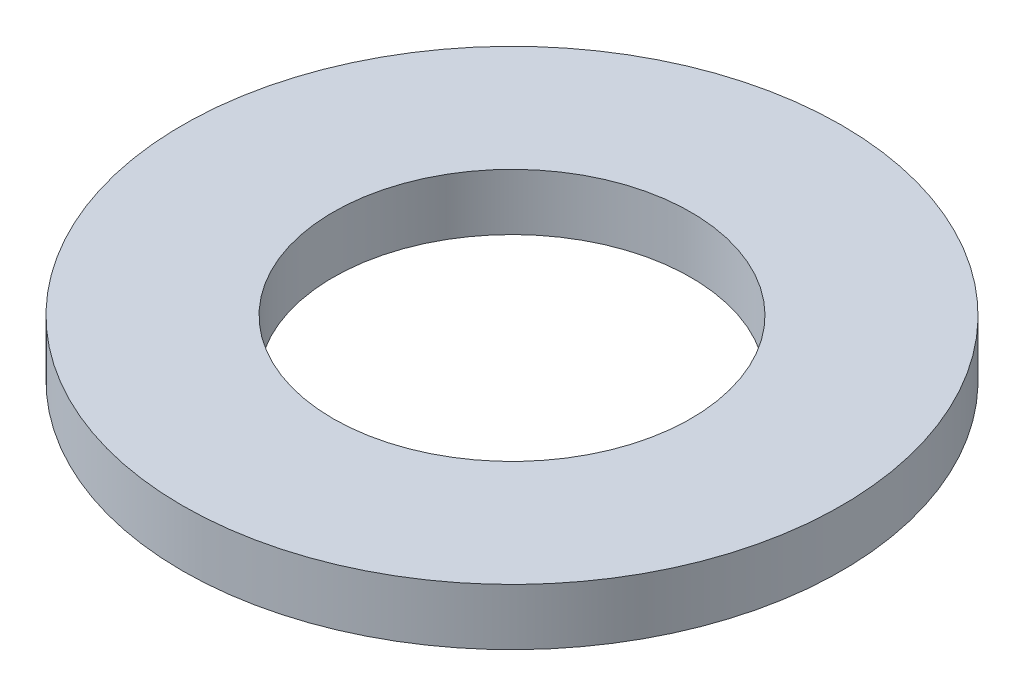
ISO-10303-21;
HEADER;
FILE_DESCRIPTION(('STEP AP214'),'2;1');
FILE_NAME('part.step','',(''),(''),'','','');
FILE_SCHEMA(('AUTOMOTIVE_DESIGN { 1 0 10303 214 1 1 1 1 }'));
ENDSEC;
DATA;
#1=APPLICATION_CONTEXT('core data for automotive mechanical design processes');
#2=APPLICATION_PROTOCOL_DEFINITION('international standard','automotive_design',2000,#1);
#3=PRODUCT_CONTEXT('',#1,'mechanical');
#4=PRODUCT('Part','Part','',(#3));
#5=PRODUCT_RELATED_PRODUCT_CATEGORY('part','',(#4));
#6=PRODUCT_DEFINITION_FORMATION('','',#4);
#7=PRODUCT_DEFINITION_CONTEXT('part definition',#1,'design');
#8=PRODUCT_DEFINITION('design','',#6,#7);
#9=PRODUCT_DEFINITION_SHAPE('','',#8);
#10=(LENGTH_UNIT() NAMED_UNIT(*) SI_UNIT(.MILLI.,.METRE.));
#11=(NAMED_UNIT(*) PLANE_ANGLE_UNIT() SI_UNIT($,.RADIAN.));
#12=(NAMED_UNIT(*) SI_UNIT($,.STERADIAN.) SOLID_ANGLE_UNIT());
#13=UNCERTAINTY_MEASURE_WITH_UNIT(LENGTH_MEASURE(1.E-05),#10,'distance_accuracy_value','');
#14=(GEOMETRIC_REPRESENTATION_CONTEXT(3) GLOBAL_UNCERTAINTY_ASSIGNED_CONTEXT((#13)) GLOBAL_UNIT_ASSIGNED_CONTEXT((#10,
#11,#12)) REPRESENTATION_CONTEXT('',''));
#15=CARTESIAN_POINT('',(0.,0.,0.));
#16=DIRECTION('',(0.,0.,1.));
#17=DIRECTION('',(1.,0.,0.));
#18=AXIS2_PLACEMENT_3D('',#15,#16,#17);
#19=CARTESIAN_POINT('',(0.,15.,0.));
#20=DIRECTION('',(0.,-1.,0.));
#21=DIRECTION('',(0.,0.,-1.));
#22=AXIS2_PLACEMENT_3D('',#19,#20,#21);
#23=CYLINDRICAL_SURFACE('',#22,87.5);
#24=CARTESIAN_POINT('',(0.,15.,0.));
#25=DIRECTION('',(0.,1.,0.));
#26=DIRECTION('',(0.,0.,1.));
#27=AXIS2_PLACEMENT_3D('',#24,#25,#26);
#28=CIRCLE('',#27,87.5);
#29=CARTESIAN_POINT('',(0.,15.,87.5));
#30=VERTEX_POINT('',#29);
#31=EDGE_CURVE('E10',#30,#30,#28,.T.);
#32=ORIENTED_EDGE('',*,*,#31,.F.);
#33=EDGE_LOOP('',(#32));
#34=FACE_BOUND('',#33,.T.);
#35=CARTESIAN_POINT('',(0.,0.,0.));
#36=DIRECTION('',(0.,1.,0.));
#37=DIRECTION('',(0.,0.,1.));
#38=AXIS2_PLACEMENT_3D('',#35,#36,#37);
#39=CIRCLE('',#38,87.5);
#40=CARTESIAN_POINT('',(0.,0.,87.5));
#41=VERTEX_POINT('',#40);
#42=EDGE_CURVE('E37',#41,#41,#39,.T.);
#43=ORIENTED_EDGE('',*,*,#42,.T.);
#44=EDGE_LOOP('',(#43));
#45=FACE_BOUND('',#44,.T.);
#46=ADVANCED_FACE('F40',(#34,#45),#23,.T.);
#47=CARTESIAN_POINT('',(0.,15.,0.));
#48=DIRECTION('',(0.,1.,0.));
#49=DIRECTION('',(0.,0.,1.));
#50=AXIS2_PLACEMENT_3D('',#47,#48,#49);
#51=PLANE('',#50);
#52=CARTESIAN_POINT('',(0.,15.,0.));
#53=DIRECTION('',(0.,1.,0.));
#54=DIRECTION('',(0.,0.,1.));
#55=AXIS2_PLACEMENT_3D('',#52,#53,#54);
#56=CIRCLE('',#55,47.5);
#57=CARTESIAN_POINT('',(0.,15.,47.5));
#58=VERTEX_POINT('',#57);
#59=EDGE_CURVE('E50',#58,#58,#56,.T.);
#60=ORIENTED_EDGE('',*,*,#59,.F.);
#61=EDGE_LOOP('',(#60));
#62=FACE_BOUND('',#61,.T.);
#63=ORIENTED_EDGE('',*,*,#31,.T.);
#64=EDGE_LOOP('',(#63));
#65=FACE_BOUND('',#64,.T.);
#66=ADVANCED_FACE('F59',(#62,#65),#51,.T.);
#67=CARTESIAN_POINT('',(0.,0.,0.));
#68=DIRECTION('',(0.,1.,0.));
#69=DIRECTION('',(0.,0.,1.));
#70=AXIS2_PLACEMENT_3D('',#67,#68,#69);
#71=PLANE('',#70);
#72=CARTESIAN_POINT('',(0.,0.,0.));
#73=DIRECTION('',(0.,1.,0.));
#74=DIRECTION('',(0.,0.,1.));
#75=AXIS2_PLACEMENT_3D('',#72,#73,#74);
#76=CIRCLE('',#75,47.5);
#77=CARTESIAN_POINT('',(0.,0.,47.5));
#78=VERTEX_POINT('',#77);
#79=EDGE_CURVE('E47',#78,#78,#76,.T.);
#80=ORIENTED_EDGE('',*,*,#79,.T.);
#81=EDGE_LOOP('',(#80));
#82=FACE_BOUND('',#81,.T.);
#83=ORIENTED_EDGE('',*,*,#42,.F.);
#84=EDGE_LOOP('',(#83));
#85=FACE_BOUND('',#84,.T.);
#86=ADVANCED_FACE('F58',(#82,#85),#71,.F.);
#87=CARTESIAN_POINT('',(0.,15.,0.));
#88=DIRECTION('',(0.,-1.,0.));
#89=DIRECTION('',(0.,0.,-1.));
#90=AXIS2_PLACEMENT_3D('',#87,#88,#89);
#91=CYLINDRICAL_SURFACE('',#90,47.5);
#92=ORIENTED_EDGE('',*,*,#59,.T.);
#93=EDGE_LOOP('',(#92));
#94=FACE_BOUND('',#93,.T.);
#95=ORIENTED_EDGE('',*,*,#79,.F.);
#96=EDGE_LOOP('',(#95));
#97=FACE_BOUND('',#96,.T.);
#98=ADVANCED_FACE('F54',(#94,#97),#91,.F.);
#99=CLOSED_SHELL('',(#46,#66,#86,#98));
#100=MANIFOLD_SOLID_BREP('B2',#99);
#101=ADVANCED_BREP_SHAPE_REPRESENTATION('',(#18,#100),#14);
#102=SHAPE_DEFINITION_REPRESENTATION(#9,#101);
ENDSEC;
END-ISO-10303-21;
